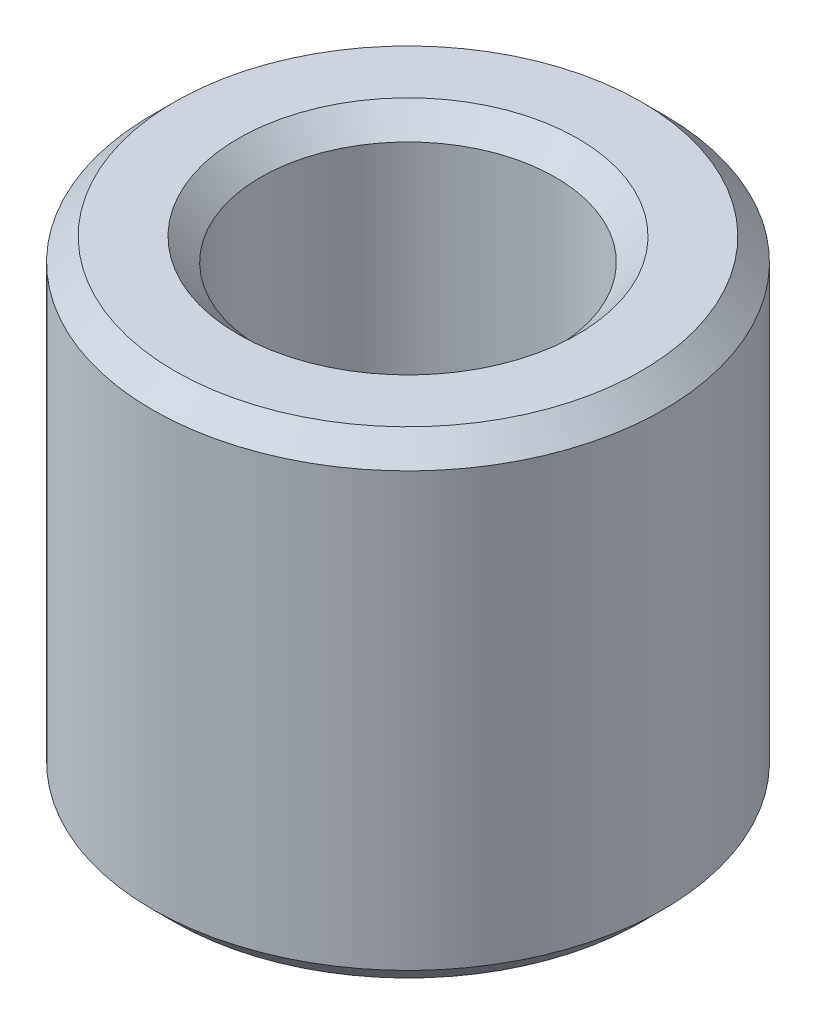
ISO-10303-21;
HEADER;
FILE_DESCRIPTION(('STEP AP214'),'2;1');
FILE_NAME('part.step','',(''),(''),'','','');
FILE_SCHEMA(('AUTOMOTIVE_DESIGN { 1 0 10303 214 1 1 1 1 }'));
ENDSEC;
DATA;
#1=APPLICATION_CONTEXT('core data for automotive mechanical design processes');
#2=APPLICATION_PROTOCOL_DEFINITION('international standard','automotive_design',2000,#1);
#3=PRODUCT_CONTEXT('',#1,'mechanical');
#4=PRODUCT('Part','Part','',(#3));
#5=PRODUCT_RELATED_PRODUCT_CATEGORY('part','',(#4));
#6=PRODUCT_DEFINITION_FORMATION('','',#4);
#7=PRODUCT_DEFINITION_CONTEXT('part definition',#1,'design');
#8=PRODUCT_DEFINITION('design','',#6,#7);
#9=PRODUCT_DEFINITION_SHAPE('','',#8);
#10=(LENGTH_UNIT() NAMED_UNIT(*) SI_UNIT(.MILLI.,.METRE.));
#11=(NAMED_UNIT(*) PLANE_ANGLE_UNIT() SI_UNIT($,.RADIAN.));
#12=(NAMED_UNIT(*) SI_UNIT($,.STERADIAN.) SOLID_ANGLE_UNIT());
#13=UNCERTAINTY_MEASURE_WITH_UNIT(LENGTH_MEASURE(1.E-05),#10,'distance_accuracy_value','');
#14=(GEOMETRIC_REPRESENTATION_CONTEXT(3) GLOBAL_UNCERTAINTY_ASSIGNED_CONTEXT((#13)) GLOBAL_UNIT_ASSIGNED_CONTEXT((#10,
#11,#12)) REPRESENTATION_CONTEXT('',''));
#15=CARTESIAN_POINT('',(0.,0.,0.));
#16=DIRECTION('',(0.,0.,1.));
#17=DIRECTION('',(1.,0.,0.));
#18=AXIS2_PLACEMENT_3D('',#15,#16,#17);
#19=CARTESIAN_POINT('',(0.,70.0335834087823,0.));
#20=DIRECTION('',(0.,-1.,0.));
#21=DIRECTION('',(0.,0.,-1.));
#22=AXIS2_PLACEMENT_3D('',#19,#20,#21);
#23=CYLINDRICAL_SURFACE('',#22,37.5);
#24=CARTESIAN_POINT('',(0.,3.28414705359843,0.));
#25=DIRECTION('',(0.,1.,0.));
#26=DIRECTION('',(0.,0.,1.));
#27=AXIS2_PLACEMENT_3D('',#24,#25,#26);
#28=CIRCLE('',#27,37.5);
#29=CARTESIAN_POINT('',(0.,3.28414705359843,37.5));
#30=VERTEX_POINT('',#29);
#31=EDGE_CURVE('E10',#30,#30,#28,.T.);
#32=ORIENTED_EDGE('',*,*,#31,.T.);
#33=EDGE_LOOP('',(#32));
#34=FACE_BOUND('',#33,.T.);
#35=CARTESIAN_POINT('',(0.,66.7494363551839,0.));
#36=DIRECTION('',(0.,1.,0.));
#37=DIRECTION('',(0.,0.,1.));
#38=AXIS2_PLACEMENT_3D('',#35,#36,#37);
#39=CIRCLE('',#38,37.5);
#40=CARTESIAN_POINT('',(0.,66.7494363551839,37.5));
#41=VERTEX_POINT('',#40);
#42=EDGE_CURVE('E50',#41,#41,#39,.F.);
#43=ORIENTED_EDGE('',*,*,#42,.T.);
#44=EDGE_LOOP('',(#43));
#45=FACE_BOUND('',#44,.T.);
#46=ADVANCED_FACE('F39',(#34,#45),#23,.T.);
#47=CARTESIAN_POINT('',(0.,70.0335834087823,0.));
#48=DIRECTION('',(0.,1.,0.));
#49=DIRECTION('',(0.,0.,1.));
#50=AXIS2_PLACEMENT_3D('',#47,#48,#49);
#51=PLANE('',#50);
#52=CARTESIAN_POINT('',(0.,70.0335834087823,0.));
#53=DIRECTION('',(0.,1.,0.));
#54=DIRECTION('',(0.,0.,1.));
#55=AXIS2_PLACEMENT_3D('',#52,#53,#54);
#56=CIRCLE('',#55,24.9014245775534);
#57=CARTESIAN_POINT('',(0.,70.0335834087823,24.9014245775534));
#58=VERTEX_POINT('',#57);
#59=EDGE_CURVE('E58',#58,#58,#56,.F.);
#60=ORIENTED_EDGE('',*,*,#59,.T.);
#61=EDGE_LOOP('',(#60));
#62=FACE_BOUND('',#61,.T.);
#63=CARTESIAN_POINT('',(0.,70.0335834087823,0.));
#64=DIRECTION('',(0.,1.,0.));
#65=DIRECTION('',(0.,0.,1.));
#66=AXIS2_PLACEMENT_3D('',#63,#64,#65);
#67=CIRCLE('',#66,34.2158529464016);
#68=CARTESIAN_POINT('',(0.,70.0335834087823,34.2158529464016));
#69=VERTEX_POINT('',#68);
#70=EDGE_CURVE('E61',#69,#69,#67,.T.);
#71=ORIENTED_EDGE('',*,*,#70,.T.);
#72=EDGE_LOOP('',(#71));
#73=FACE_BOUND('',#72,.T.);
#74=ADVANCED_FACE('F88',(#62,#73),#51,.T.);
#75=CARTESIAN_POINT('',(0.,0.,0.));
#76=DIRECTION('',(0.,1.,0.));
#77=DIRECTION('',(0.,0.,1.));
#78=AXIS2_PLACEMENT_3D('',#75,#76,#77);
#79=PLANE('',#78);
#80=CARTESIAN_POINT('',(0.,0.,0.));
#81=DIRECTION('',(0.,1.,0.));
#82=DIRECTION('',(0.,0.,1.));
#83=AXIS2_PLACEMENT_3D('',#80,#81,#82);
#84=CIRCLE('',#83,24.9014245775534);
#85=CARTESIAN_POINT('',(0.,0.,24.9014245775534));
#86=VERTEX_POINT('',#85);
#87=EDGE_CURVE('E51',#86,#86,#84,.T.);
#88=ORIENTED_EDGE('',*,*,#87,.T.);
#89=EDGE_LOOP('',(#88));
#90=FACE_BOUND('',#89,.T.);
#91=CARTESIAN_POINT('',(0.,0.,0.));
#92=DIRECTION('',(0.,1.,0.));
#93=DIRECTION('',(0.,0.,1.));
#94=AXIS2_PLACEMENT_3D('',#91,#92,#93);
#95=CIRCLE('',#94,34.2158529464015);
#96=CARTESIAN_POINT('',(0.,0.,34.2158529464015));
#97=VERTEX_POINT('',#96);
#98=EDGE_CURVE('E54',#97,#97,#95,.F.);
#99=ORIENTED_EDGE('',*,*,#98,.T.);
#100=EDGE_LOOP('',(#99));
#101=FACE_BOUND('',#100,.T.);
#102=ADVANCED_FACE('F83',(#90,#101),#79,.F.);
#103=CARTESIAN_POINT('',(0.,70.0335834087823,0.));
#104=DIRECTION('',(0.,-1.,0.));
#105=DIRECTION('',(0.,0.,-1.));
#106=AXIS2_PLACEMENT_3D('',#103,#104,#105);
#107=CYLINDRICAL_SURFACE('',#106,21.6172775239549);
#108=CARTESIAN_POINT('',(0.,66.7494363551839,0.));
#109=DIRECTION('',(0.,1.,0.));
#110=DIRECTION('',(0.,0.,1.));
#111=AXIS2_PLACEMENT_3D('',#108,#109,#110);
#112=CIRCLE('',#111,21.6172775239549);
#113=CARTESIAN_POINT('',(0.,66.7494363551839,21.6172775239549));
#114=VERTEX_POINT('',#113);
#115=EDGE_CURVE('E67',#114,#114,#112,.T.);
#116=ORIENTED_EDGE('',*,*,#115,.T.);
#117=EDGE_LOOP('',(#116));
#118=FACE_BOUND('',#117,.T.);
#119=CARTESIAN_POINT('',(0.,3.28414705359847,0.));
#120=DIRECTION('',(0.,1.,0.));
#121=DIRECTION('',(0.,0.,1.));
#122=AXIS2_PLACEMENT_3D('',#119,#120,#121);
#123=CIRCLE('',#122,21.6172775239549);
#124=CARTESIAN_POINT('',(0.,3.28414705359847,21.6172775239549));
#125=VERTEX_POINT('',#124);
#126=EDGE_CURVE('E69',#125,#125,#123,.F.);
#127=ORIENTED_EDGE('',*,*,#126,.T.);
#128=EDGE_LOOP('',(#127));
#129=FACE_BOUND('',#128,.T.);
#130=ADVANCED_FACE('F71',(#118,#129),#107,.F.);
#131=CARTESIAN_POINT('',(0.,66.7494363551839,0.));
#132=DIRECTION('',(0.,1.,0.));
#133=DIRECTION('',(0.,0.,1.));
#134=AXIS2_PLACEMENT_3D('',#131,#132,#133);
#135=CONICAL_SURFACE('',#134,21.6172775239549,0.785398163397451);
#136=ORIENTED_EDGE('',*,*,#59,.F.);
#137=EDGE_LOOP('',(#136));
#138=FACE_BOUND('',#137,.T.);
#139=ORIENTED_EDGE('',*,*,#115,.F.);
#140=EDGE_LOOP('',(#139));
#141=FACE_BOUND('',#140,.T.);
#142=ADVANCED_FACE('F77',(#138,#141),#135,.F.);
#143=CARTESIAN_POINT('',(0.,0.,0.));
#144=DIRECTION('',(0.,-1.,0.));
#145=DIRECTION('',(0.,0.,-1.));
#146=AXIS2_PLACEMENT_3D('',#143,#144,#145);
#147=CONICAL_SURFACE('',#146,24.9014245775534,0.785398163397445);
#148=ORIENTED_EDGE('',*,*,#126,.F.);
#149=EDGE_LOOP('',(#148));
#150=FACE_BOUND('',#149,.T.);
#151=ORIENTED_EDGE('',*,*,#87,.F.);
#152=EDGE_LOOP('',(#151));
#153=FACE_BOUND('',#152,.T.);
#154=ADVANCED_FACE('F73',(#150,#153),#147,.F.);
#155=CARTESIAN_POINT('',(0.,3.28414705359843,0.));
#156=DIRECTION('',(0.,1.,0.));
#157=DIRECTION('',(0.,0.,1.));
#158=AXIS2_PLACEMENT_3D('',#155,#156,#157);
#159=CONICAL_SURFACE('',#158,37.5,0.785398163397454);
#160=ORIENTED_EDGE('',*,*,#98,.F.);
#161=EDGE_LOOP('',(#160));
#162=FACE_BOUND('',#161,.T.);
#163=ORIENTED_EDGE('',*,*,#31,.F.);
#164=EDGE_LOOP('',(#163));
#165=FACE_BOUND('',#164,.T.);
#166=ADVANCED_FACE('F76',(#162,#165),#159,.T.);
#167=CARTESIAN_POINT('',(0.,70.0335834087823,0.));
#168=DIRECTION('',(0.,-1.,0.));
#169=DIRECTION('',(0.,0.,-1.));
#170=AXIS2_PLACEMENT_3D('',#167,#168,#169);
#171=CONICAL_SURFACE('',#170,34.2158529464016,0.785398163397444);
#172=ORIENTED_EDGE('',*,*,#42,.F.);
#173=EDGE_LOOP('',(#172));
#174=FACE_BOUND('',#173,.T.);
#175=ORIENTED_EDGE('',*,*,#70,.F.);
#176=EDGE_LOOP('',(#175));
#177=FACE_BOUND('',#176,.T.);
#178=ADVANCED_FACE('F45',(#174,#177),#171,.T.);
#179=CLOSED_SHELL('',(#46,#74,#102,#130,#142,#154,#166,#178));
#180=MANIFOLD_SOLID_BREP('B2',#179);
#181=ADVANCED_BREP_SHAPE_REPRESENTATION('',(#18,#180),#14);
#182=SHAPE_DEFINITION_REPRESENTATION(#9,#181);
ENDSEC;
END-ISO-10303-21;
